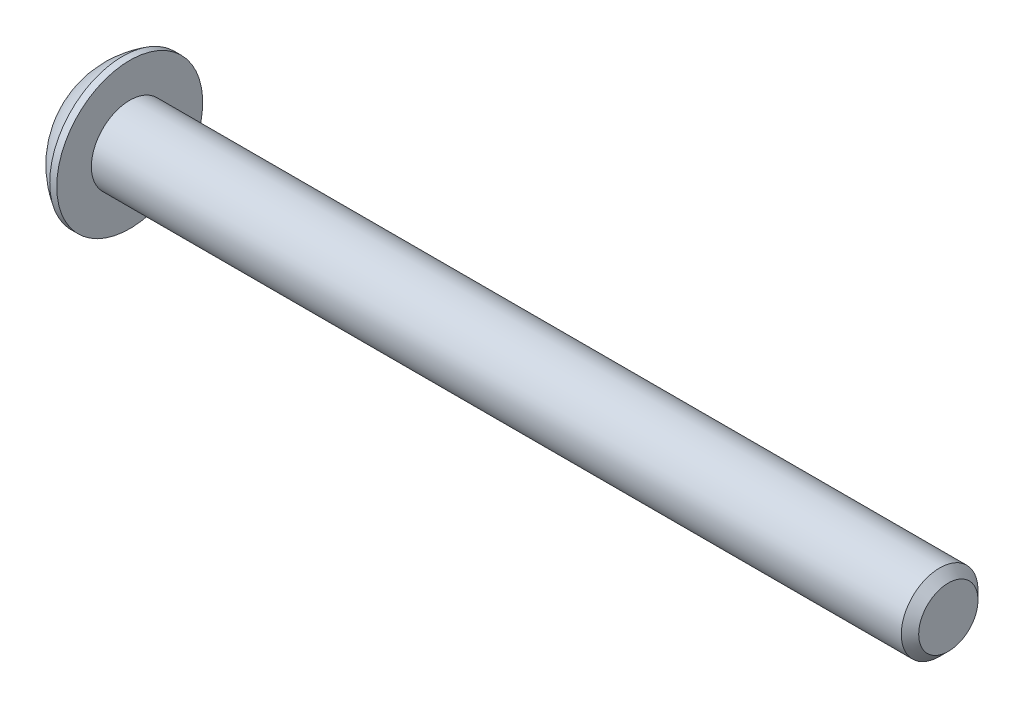
ISO-10303-21;
HEADER;
FILE_DESCRIPTION(('STEP AP214'),'2;1');
FILE_NAME('part.step','',(''),(''),'','','');
FILE_SCHEMA(('AUTOMOTIVE_DESIGN { 1 0 10303 214 1 1 1 1 }'));
ENDSEC;
DATA;
#1=APPLICATION_CONTEXT('core data for automotive mechanical design processes');
#2=APPLICATION_PROTOCOL_DEFINITION('international standard','automotive_design',2000,#1);
#3=PRODUCT_CONTEXT('',#1,'mechanical');
#4=PRODUCT('Part','Part','',(#3));
#5=PRODUCT_RELATED_PRODUCT_CATEGORY('part','',(#4));
#6=PRODUCT_DEFINITION_FORMATION('','',#4);
#7=PRODUCT_DEFINITION_CONTEXT('part definition',#1,'design');
#8=PRODUCT_DEFINITION('design','',#6,#7);
#9=PRODUCT_DEFINITION_SHAPE('','',#8);
#10=(LENGTH_UNIT() NAMED_UNIT(*) SI_UNIT(.MILLI.,.METRE.));
#11=(NAMED_UNIT(*) PLANE_ANGLE_UNIT() SI_UNIT($,.RADIAN.));
#12=(NAMED_UNIT(*) SI_UNIT($,.STERADIAN.) SOLID_ANGLE_UNIT());
#13=UNCERTAINTY_MEASURE_WITH_UNIT(LENGTH_MEASURE(1.E-05),#10,'distance_accuracy_value','');
#14=(GEOMETRIC_REPRESENTATION_CONTEXT(3) GLOBAL_UNCERTAINTY_ASSIGNED_CONTEXT((#13)) GLOBAL_UNIT_ASSIGNED_CONTEXT((#10,
#11,#12)) REPRESENTATION_CONTEXT('',''));
#15=CARTESIAN_POINT('',(0.,0.,0.));
#16=DIRECTION('',(0.,0.,1.));
#17=DIRECTION('',(1.,0.,0.));
#18=AXIS2_PLACEMENT_3D('',#15,#16,#17);
#19=CARTESIAN_POINT('',(1.32080000000034,0.,0.));
#20=DIRECTION('',(-1.,0.,0.));
#21=DIRECTION('',(0.,0.,1.));
#22=AXIS2_PLACEMENT_3D('',#19,#20,#21);
#23=CONICAL_SURFACE('',#22,1.1937999999998,1.04719755119608);
#24=CARTESIAN_POINT('',(2.01004075135902,0.,4.44089209850063E-13));
#25=VERTEX_POINT('',#24);
#26=VERTEX_LOOP('',#25);
#27=FACE_BOUND('',#26,.T.);
#28=CARTESIAN_POINT('',(1.32080000000009,0.,0.));
#29=DIRECTION('',(-1.,0.,0.));
#30=DIRECTION('',(0.,0.,1.));
#31=AXIS2_PLACEMENT_3D('',#28,#29,#30);
#32=CIRCLE('',#31,1.19380000000024);
#33=CARTESIAN_POINT('',(1.32080000000004,-1.03386112703797,0.59690000000006));
#34=VERTEX_POINT('',#33);
#35=CARTESIAN_POINT('',(1.32080000000004,0.,1.19380000000012));
#36=VERTEX_POINT('',#35);
#37=EDGE_CURVE('E19',#34,#36,#32,.T.);
#38=ORIENTED_EDGE('',*,*,#37,.T.);
#39=CARTESIAN_POINT('',(1.32080000000009,0.,0.));
#40=DIRECTION('',(-1.,0.,0.));
#41=DIRECTION('',(0.,0.,1.));
#42=AXIS2_PLACEMENT_3D('',#39,#40,#41);
#43=CIRCLE('',#42,1.19380000000024);
#44=CARTESIAN_POINT('',(1.32080000000004,1.03386112703797,0.596900000000061));
#45=VERTEX_POINT('',#44);
#46=EDGE_CURVE('E147',#36,#45,#43,.T.);
#47=ORIENTED_EDGE('',*,*,#46,.T.);
#48=CARTESIAN_POINT('',(1.32080000000009,0.,0.));
#49=DIRECTION('',(-1.,0.,0.));
#50=DIRECTION('',(0.,0.,1.));
#51=AXIS2_PLACEMENT_3D('',#48,#49,#50);
#52=CIRCLE('',#51,1.19380000000024);
#53=CARTESIAN_POINT('',(1.32080000000004,1.03386112703797,-0.596900000000061));
#54=VERTEX_POINT('',#53);
#55=EDGE_CURVE('E402',#45,#54,#52,.T.);
#56=ORIENTED_EDGE('',*,*,#55,.T.);
#57=CARTESIAN_POINT('',(1.32080000000009,0.,0.));
#58=DIRECTION('',(-1.,0.,0.));
#59=DIRECTION('',(0.,0.,1.));
#60=AXIS2_PLACEMENT_3D('',#57,#58,#59);
#61=CIRCLE('',#60,1.19380000000024);
#62=CARTESIAN_POINT('',(1.32080000000004,1.49457637585666E-12,-1.19380000000012));
#63=VERTEX_POINT('',#62);
#64=EDGE_CURVE('E403',#54,#63,#61,.T.);
#65=ORIENTED_EDGE('',*,*,#64,.T.);
#66=CARTESIAN_POINT('',(1.32080000000009,0.,0.));
#67=DIRECTION('',(-1.,0.,0.));
#68=DIRECTION('',(0.,0.,1.));
#69=AXIS2_PLACEMENT_3D('',#66,#67,#68);
#70=CIRCLE('',#69,1.19380000000024);
#71=CARTESIAN_POINT('',(1.32080000000004,-1.03386112703797,-0.59690000000006));
#72=VERTEX_POINT('',#71);
#73=EDGE_CURVE('E92',#63,#72,#70,.T.);
#74=ORIENTED_EDGE('',*,*,#73,.T.);
#75=CARTESIAN_POINT('',(1.32080000000009,0.,0.));
#76=DIRECTION('',(-1.,0.,0.));
#77=DIRECTION('',(0.,0.,1.));
#78=AXIS2_PLACEMENT_3D('',#75,#76,#77);
#79=CIRCLE('',#78,1.19380000000024);
#80=EDGE_CURVE('E88',#72,#34,#79,.T.);
#81=ORIENTED_EDGE('',*,*,#80,.T.);
#82=EDGE_LOOP('',(#38,#47,#56,#65,#74,#81));
#83=FACE_BOUND('',#82,.T.);
#84=ADVANCED_FACE('F16',(#27,#83),#23,.F.);
#85=CARTESIAN_POINT('',(1.3208,-2.06772225407572,-1.1938));
#86=DIRECTION('',(1.,0.,0.));
#87=DIRECTION('',(0.,0.,-1.));
#88=AXIS2_PLACEMENT_3D('',#85,#86,#87);
#89=PLANE('',#88);
#90=DIRECTION('',(0.,0.5,0.866025403784439));
#91=VECTOR('',#90,1.);
#92=CARTESIAN_POINT('',(1.3208,-1.37848150271715,0.));
#93=LINE('',#92,#91);
#94=CARTESIAN_POINT('',(1.3208,-0.689240751358574,1.1938));
#95=VERTEX_POINT('',#94);
#96=EDGE_CURVE('E100',#95,#34,#93,.F.);
#97=ORIENTED_EDGE('',*,*,#96,.F.);
#98=DIRECTION('',(0.,1.,0.));
#99=VECTOR('',#98,1.);
#100=CARTESIAN_POINT('',(1.3208,-0.689240751358574,1.1938));
#101=LINE('',#100,#99);
#102=EDGE_CURVE('E102',#36,#95,#101,.F.);
#103=ORIENTED_EDGE('',*,*,#102,.F.);
#104=ORIENTED_EDGE('',*,*,#37,.F.);
#105=EDGE_LOOP('',(#97,#103,#104));
#106=FACE_BOUND('',#105,.T.);
#107=ADVANCED_FACE('F98',(#106),#89,.F.);
#108=CARTESIAN_POINT('',(1.3208,-2.06772225407572,-1.1938));
#109=DIRECTION('',(1.,0.,0.));
#110=DIRECTION('',(0.,0.,-1.));
#111=AXIS2_PLACEMENT_3D('',#108,#109,#110);
#112=PLANE('',#111);
#113=DIRECTION('',(0.,-0.5,0.866025403784439));
#114=VECTOR('',#113,1.);
#115=CARTESIAN_POINT('',(1.3208,-0.689240751358574,-1.1938));
#116=LINE('',#115,#114);
#117=CARTESIAN_POINT('',(1.3208,-1.37848150271715,0.));
#118=VERTEX_POINT('',#117);
#119=EDGE_CURVE('E108',#118,#72,#116,.F.);
#120=ORIENTED_EDGE('',*,*,#119,.F.);
#121=DIRECTION('',(0.,0.5,0.866025403784439));
#122=VECTOR('',#121,1.);
#123=CARTESIAN_POINT('',(1.3208,-1.37848150271715,0.));
#124=LINE('',#123,#122);
#125=EDGE_CURVE('E105',#34,#118,#124,.F.);
#126=ORIENTED_EDGE('',*,*,#125,.F.);
#127=ORIENTED_EDGE('',*,*,#80,.F.);
#128=EDGE_LOOP('',(#120,#126,#127));
#129=FACE_BOUND('',#128,.T.);
#130=ADVANCED_FACE('F106',(#129),#112,.F.);
#131=CARTESIAN_POINT('',(1.3208,-2.06772225407572,-1.1938));
#132=DIRECTION('',(1.,0.,0.));
#133=DIRECTION('',(0.,0.,-1.));
#134=AXIS2_PLACEMENT_3D('',#131,#132,#133);
#135=PLANE('',#134);
#136=DIRECTION('',(0.,1.,0.));
#137=VECTOR('',#136,1.);
#138=CARTESIAN_POINT('',(1.3208,0.689240751358577,-1.1938));
#139=LINE('',#138,#137);
#140=CARTESIAN_POINT('',(1.3208,-0.689240751358574,-1.1938));
#141=VERTEX_POINT('',#140);
#142=EDGE_CURVE('E373',#141,#63,#139,.T.);
#143=ORIENTED_EDGE('',*,*,#142,.F.);
#144=DIRECTION('',(0.,-0.5,0.866025403784439));
#145=VECTOR('',#144,1.);
#146=CARTESIAN_POINT('',(1.3208,-0.689240751358574,-1.1938));
#147=LINE('',#146,#145);
#148=EDGE_CURVE('E385',#72,#141,#147,.F.);
#149=ORIENTED_EDGE('',*,*,#148,.F.);
#150=ORIENTED_EDGE('',*,*,#73,.F.);
#151=EDGE_LOOP('',(#143,#149,#150));
#152=FACE_BOUND('',#151,.T.);
#153=ADVANCED_FACE('F190',(#152),#135,.F.);
#154=CARTESIAN_POINT('',(1.3208,-2.06772225407572,-1.1938));
#155=DIRECTION('',(1.,0.,0.));
#156=DIRECTION('',(0.,0.,-1.));
#157=AXIS2_PLACEMENT_3D('',#154,#155,#156);
#158=PLANE('',#157);
#159=DIRECTION('',(0.,-0.5,-0.866025403784439));
#160=VECTOR('',#159,1.);
#161=CARTESIAN_POINT('',(1.3208,1.37848150271715,0.));
#162=LINE('',#161,#160);
#163=CARTESIAN_POINT('',(1.3208,0.689240751358577,-1.1938));
#164=VERTEX_POINT('',#163);
#165=EDGE_CURVE('E359',#164,#54,#162,.F.);
#166=ORIENTED_EDGE('',*,*,#165,.F.);
#167=DIRECTION('',(0.,1.,0.));
#168=VECTOR('',#167,1.);
#169=CARTESIAN_POINT('',(1.3208,0.689240751358577,-1.1938));
#170=LINE('',#169,#168);
#171=EDGE_CURVE('E370',#63,#164,#170,.T.);
#172=ORIENTED_EDGE('',*,*,#171,.F.);
#173=ORIENTED_EDGE('',*,*,#64,.F.);
#174=EDGE_LOOP('',(#166,#172,#173));
#175=FACE_BOUND('',#174,.T.);
#176=ADVANCED_FACE('F186',(#175),#158,.F.);
#177=CARTESIAN_POINT('',(1.3208,-2.06772225407572,-1.1938));
#178=DIRECTION('',(1.,0.,0.));
#179=DIRECTION('',(0.,0.,-1.));
#180=AXIS2_PLACEMENT_3D('',#177,#178,#179);
#181=PLANE('',#180);
#182=DIRECTION('',(0.,0.5,-0.866025403784439));
#183=VECTOR('',#182,1.);
#184=CARTESIAN_POINT('',(1.3208,0.689240751358576,1.1938));
#185=LINE('',#184,#183);
#186=CARTESIAN_POINT('',(1.3208,1.37848150271715,0.));
#187=VERTEX_POINT('',#186);
#188=EDGE_CURVE('E338',#187,#45,#185,.F.);
#189=ORIENTED_EDGE('',*,*,#188,.F.);
#190=DIRECTION('',(0.,-0.5,-0.866025403784439));
#191=VECTOR('',#190,1.);
#192=CARTESIAN_POINT('',(1.3208,1.37848150271715,0.));
#193=LINE('',#192,#191);
#194=EDGE_CURVE('E357',#54,#187,#193,.F.);
#195=ORIENTED_EDGE('',*,*,#194,.F.);
#196=ORIENTED_EDGE('',*,*,#55,.F.);
#197=EDGE_LOOP('',(#189,#195,#196));
#198=FACE_BOUND('',#197,.T.);
#199=ADVANCED_FACE('F182',(#198),#181,.F.);
#200=CARTESIAN_POINT('',(1.3208,-2.06772225407572,-1.1938));
#201=DIRECTION('',(1.,0.,0.));
#202=DIRECTION('',(0.,0.,-1.));
#203=AXIS2_PLACEMENT_3D('',#200,#201,#202);
#204=PLANE('',#203);
#205=DIRECTION('',(0.,1.,0.));
#206=VECTOR('',#205,1.);
#207=CARTESIAN_POINT('',(1.3208,-0.689240751358574,1.1938));
#208=LINE('',#207,#206);
#209=CARTESIAN_POINT('',(1.3208,0.689240751358576,1.1938));
#210=VERTEX_POINT('',#209);
#211=EDGE_CURVE('E117',#210,#36,#208,.F.);
#212=ORIENTED_EDGE('',*,*,#211,.F.);
#213=DIRECTION('',(0.,0.5,-0.866025403784439));
#214=VECTOR('',#213,1.);
#215=CARTESIAN_POINT('',(1.3208,0.689240751358576,1.1938));
#216=LINE('',#215,#214);
#217=EDGE_CURVE('E341',#45,#210,#216,.F.);
#218=ORIENTED_EDGE('',*,*,#217,.F.);
#219=ORIENTED_EDGE('',*,*,#46,.F.);
#220=EDGE_LOOP('',(#212,#218,#219));
#221=FACE_BOUND('',#220,.T.);
#222=ADVANCED_FACE('F178',(#221),#204,.F.);
#223=CARTESIAN_POINT('',(1.3208,-0.689240751358574,1.1938));
#224=DIRECTION('',(0.,0.,-1.));
#225=DIRECTION('',(0.,1.,0.));
#226=AXIS2_PLACEMENT_3D('',#223,#224,#225);
#227=PLANE('',#226);
#228=DIRECTION('',(0.,1.,0.));
#229=VECTOR('',#228,1.);
#230=CARTESIAN_POINT('',(0.,0.,1.1938));
#231=LINE('',#230,#229);
#232=CARTESIAN_POINT('',(0.,0.689240751358577,1.1938));
#233=VERTEX_POINT('',#232);
#234=CARTESIAN_POINT('',(0.,-0.689240751358574,1.1938));
#235=VERTEX_POINT('',#234);
#236=EDGE_CURVE('E335',#233,#235,#231,.F.);
#237=ORIENTED_EDGE('',*,*,#236,.F.);
#238=DIRECTION('',(1.,0.,0.));
#239=VECTOR('',#238,1.);
#240=CARTESIAN_POINT('',(1.3208,0.689240751358576,1.1938));
#241=LINE('',#240,#239);
#242=EDGE_CURVE('E347',#210,#233,#241,.F.);
#243=ORIENTED_EDGE('',*,*,#242,.F.);
#244=ORIENTED_EDGE('',*,*,#211,.T.);
#245=ORIENTED_EDGE('',*,*,#102,.T.);
#246=DIRECTION('',(1.,0.,0.));
#247=VECTOR('',#246,1.);
#248=CARTESIAN_POINT('',(1.3208,-0.689240751358574,1.1938));
#249=LINE('',#248,#247);
#250=EDGE_CURVE('E111',#235,#95,#249,.T.);
#251=ORIENTED_EDGE('',*,*,#250,.F.);
#252=EDGE_LOOP('',(#237,#243,#244,#245,#251));
#253=FACE_BOUND('',#252,.T.);
#254=ADVANCED_FACE('F175',(#253),#227,.T.);
#255=CARTESIAN_POINT('',(1.3208,-1.37848150271715,0.));
#256=DIRECTION('',(0.,0.866025403784439,-0.5));
#257=DIRECTION('',(0.,0.5,0.866025403784439));
#258=AXIS2_PLACEMENT_3D('',#255,#256,#257);
#259=PLANE('',#258);
#260=DIRECTION('',(0.,-0.5,-0.866025403784439));
#261=VECTOR('',#260,1.);
#262=CARTESIAN_POINT('',(0.,-0.689240751358574,1.1938));
#263=LINE('',#262,#261);
#264=CARTESIAN_POINT('',(0.,-1.37848150271715,0.));
#265=VERTEX_POINT('',#264);
#266=EDGE_CURVE('E332',#235,#265,#263,.T.);
#267=ORIENTED_EDGE('',*,*,#266,.F.);
#268=ORIENTED_EDGE('',*,*,#250,.T.);
#269=ORIENTED_EDGE('',*,*,#96,.T.);
#270=ORIENTED_EDGE('',*,*,#125,.T.);
#271=DIRECTION('',(1.,0.,0.));
#272=VECTOR('',#271,1.);
#273=CARTESIAN_POINT('',(1.3208,-1.37848150271715,0.));
#274=LINE('',#273,#272);
#275=EDGE_CURVE('E382',#265,#118,#274,.T.);
#276=ORIENTED_EDGE('',*,*,#275,.F.);
#277=EDGE_LOOP('',(#267,#268,#269,#270,#276));
#278=FACE_BOUND('',#277,.T.);
#279=ADVANCED_FACE('F115',(#278),#259,.T.);
#280=CARTESIAN_POINT('',(1.3208,-0.689240751358574,-1.1938));
#281=DIRECTION('',(0.,0.866025403784439,0.5));
#282=DIRECTION('',(0.,-0.5,0.866025403784439));
#283=AXIS2_PLACEMENT_3D('',#280,#281,#282);
#284=PLANE('',#283);
#285=DIRECTION('',(0.,0.5,-0.866025403784439));
#286=VECTOR('',#285,1.);
#287=CARTESIAN_POINT('',(0.,-1.37848150271715,0.));
#288=LINE('',#287,#286);
#289=CARTESIAN_POINT('',(0.,-0.689240751358574,-1.1938));
#290=VERTEX_POINT('',#289);
#291=EDGE_CURVE('E329',#265,#290,#288,.T.);
#292=ORIENTED_EDGE('',*,*,#291,.F.);
#293=ORIENTED_EDGE('',*,*,#275,.T.);
#294=ORIENTED_EDGE('',*,*,#119,.T.);
#295=ORIENTED_EDGE('',*,*,#148,.T.);
#296=DIRECTION('',(1.,0.,0.));
#297=VECTOR('',#296,1.);
#298=CARTESIAN_POINT('',(1.3208,-0.689240751358574,-1.1938));
#299=LINE('',#298,#297);
#300=EDGE_CURVE('E367',#290,#141,#299,.T.);
#301=ORIENTED_EDGE('',*,*,#300,.F.);
#302=EDGE_LOOP('',(#292,#293,#294,#295,#301));
#303=FACE_BOUND('',#302,.T.);
#304=ADVANCED_FACE('F168',(#303),#284,.T.);
#305=CARTESIAN_POINT('',(1.3208,0.689240751358577,-1.1938));
#306=DIRECTION('',(0.,0.,1.));
#307=DIRECTION('',(1.,0.,0.));
#308=AXIS2_PLACEMENT_3D('',#305,#306,#307);
#309=PLANE('',#308);
#310=DIRECTION('',(0.,1.,0.));
#311=VECTOR('',#310,1.);
#312=CARTESIAN_POINT('',(0.,0.,-1.1938));
#313=LINE('',#312,#311);
#314=CARTESIAN_POINT('',(0.,0.689240751358577,-1.1938));
#315=VERTEX_POINT('',#314);
#316=EDGE_CURVE('E326',#290,#315,#313,.T.);
#317=ORIENTED_EDGE('',*,*,#316,.F.);
#318=ORIENTED_EDGE('',*,*,#300,.T.);
#319=ORIENTED_EDGE('',*,*,#142,.T.);
#320=ORIENTED_EDGE('',*,*,#171,.T.);
#321=DIRECTION('',(1.,0.,0.));
#322=VECTOR('',#321,1.);
#323=CARTESIAN_POINT('',(1.3208,0.689240751358577,-1.1938));
#324=LINE('',#323,#322);
#325=EDGE_CURVE('E342',#315,#164,#324,.T.);
#326=ORIENTED_EDGE('',*,*,#325,.F.);
#327=EDGE_LOOP('',(#317,#318,#319,#320,#326));
#328=FACE_BOUND('',#327,.T.);
#329=ADVANCED_FACE('F165',(#328),#309,.T.);
#330=CARTESIAN_POINT('',(1.3208,1.37848150271715,0.));
#331=DIRECTION('',(0.,-0.866025403784439,0.5));
#332=DIRECTION('',(0.,-0.5,-0.866025403784439));
#333=AXIS2_PLACEMENT_3D('',#330,#331,#332);
#334=PLANE('',#333);
#335=DIRECTION('',(0.,0.5,0.866025403784439));
#336=VECTOR('',#335,1.);
#337=CARTESIAN_POINT('',(0.,0.689240751358577,-1.1938));
#338=LINE('',#337,#336);
#339=CARTESIAN_POINT('',(0.,1.37848150271715,0.));
#340=VERTEX_POINT('',#339);
#341=EDGE_CURVE('E323',#315,#340,#338,.T.);
#342=ORIENTED_EDGE('',*,*,#341,.F.);
#343=ORIENTED_EDGE('',*,*,#325,.T.);
#344=ORIENTED_EDGE('',*,*,#165,.T.);
#345=ORIENTED_EDGE('',*,*,#194,.T.);
#346=DIRECTION('',(1.,0.,0.));
#347=VECTOR('',#346,1.);
#348=CARTESIAN_POINT('',(1.3208,1.37848150271715,0.));
#349=LINE('',#348,#347);
#350=EDGE_CURVE('E34',#340,#187,#349,.T.);
#351=ORIENTED_EDGE('',*,*,#350,.F.);
#352=EDGE_LOOP('',(#342,#343,#344,#345,#351));
#353=FACE_BOUND('',#352,.T.);
#354=ADVANCED_FACE('F161',(#353),#334,.T.);
#355=CARTESIAN_POINT('',(1.3208,0.689240751358576,1.1938));
#356=DIRECTION('',(0.,-0.866025403784439,-0.5));
#357=DIRECTION('',(0.,0.5,-0.866025403784439));
#358=AXIS2_PLACEMENT_3D('',#355,#356,#357);
#359=PLANE('',#358);
#360=DIRECTION('',(0.,-0.5,0.866025403784439));
#361=VECTOR('',#360,1.);
#362=CARTESIAN_POINT('',(0.,1.37848150271715,0.));
#363=LINE('',#362,#361);
#364=EDGE_CURVE('E146',#340,#233,#363,.T.);
#365=ORIENTED_EDGE('',*,*,#364,.F.);
#366=ORIENTED_EDGE('',*,*,#350,.T.);
#367=ORIENTED_EDGE('',*,*,#188,.T.);
#368=ORIENTED_EDGE('',*,*,#217,.T.);
#369=ORIENTED_EDGE('',*,*,#242,.T.);
#370=EDGE_LOOP('',(#365,#366,#367,#368,#369));
#371=FACE_BOUND('',#370,.T.);
#372=ADVANCED_FACE('F157',(#371),#359,.T.);
#373=CARTESIAN_POINT('',(0.,0.,0.));
#374=DIRECTION('',(-1.,0.,0.));
#375=DIRECTION('',(0.,0.,1.));
#376=AXIS2_PLACEMENT_3D('',#373,#374,#375);
#377=PLANE('',#376);
#378=ORIENTED_EDGE('',*,*,#341,.T.);
#379=ORIENTED_EDGE('',*,*,#364,.T.);
#380=ORIENTED_EDGE('',*,*,#236,.T.);
#381=ORIENTED_EDGE('',*,*,#266,.T.);
#382=ORIENTED_EDGE('',*,*,#291,.T.);
#383=ORIENTED_EDGE('',*,*,#316,.T.);
#384=EDGE_LOOP('',(#378,#379,#380,#381,#382,#383));
#385=FACE_BOUND('',#384,.T.);
#386=CARTESIAN_POINT('',(0.,1.9812,0.));
#387=CARTESIAN_POINT('',(0.,1.9811996664299,0.0556258831179428));
#388=CARTESIAN_POINT('',(0.,1.97885520380442,0.111261989398606));
#389=CARTESIAN_POINT('',(0.,1.96949260169541,0.222149719830458));
#390=CARTESIAN_POINT('',(0.,1.96247308239605,0.277401225602895));
#391=CARTESIAN_POINT('',(0.,1.94379192841038,0.387209508139747));
#392=CARTESIAN_POINT('',(-1.85325793235264E-13,1.93212292489526,0.441765039546365));
#393=CARTESIAN_POINT('',(1.86344214223505E-13,1.90422331175315,0.549729449347493));
#394=CARTESIAN_POINT('',(6.94543371897454E-13,1.88798900035338,0.603137359208869));
#395=CARTESIAN_POINT('',(1.15501975216981E-12,1.83266214476501,0.760839131321828));
#396=CARTESIAN_POINT('',(0.,1.78690023648845,0.862876433575429));
#397=CARTESIAN_POINT('',(0.,1.67887358150667,1.05780719540872));
#398=CARTESIAN_POINT('',(9.54193214892627E-13,1.6166082074585,1.15070030720801));
#399=CARTESIAN_POINT('',(5.94805591894675E-13,1.51224157140982,1.28116890915697));
#400=CARTESIAN_POINT('',(1.63221293851378E-13,1.4755970394354,1.32320451127026));
#401=CARTESIAN_POINT('',(-1.62196980336157E-13,1.39893832619713,1.40400288695709));
#402=CARTESIAN_POINT('',(0.,1.35892742784698,1.44276877695455));
#403=CARTESIAN_POINT('',(1.14362537325405E-13,1.23416504602197,1.55382272417904));
#404=CARTESIAN_POINT('',(0.,1.14466125559859,1.62089527952111));
#405=CARTESIAN_POINT('',(0.,0.955712144178167,1.7390221808118));
#406=CARTESIAN_POINT('',(0.,0.856267198233564,1.79007713076007));
#407=CARTESIAN_POINT('',(0.,0.650206345910843,1.87477637530954));
#408=CARTESIAN_POINT('',(0.,0.543590516134855,1.90842085586267));
#409=CARTESIAN_POINT('',(0.,0.326226155292018,1.95733039300656));
#410=CARTESIAN_POINT('',(0.,0.21547760215793,1.97259535144288));
#411=CARTESIAN_POINT('',(0.,-0.00701040587544639,1.98431697865418));
#412=CARTESIAN_POINT('',(0.,-0.118749860774734,1.98077364742917));
#413=CARTESIAN_POINT('',(0.,-0.340050178355485,1.95497485623825));
#414=CARTESIAN_POINT('',(0.,-0.449611052668255,1.93271949620218));
#415=CARTESIAN_POINT('',(0.,-0.663431110729174,1.87014138774523));
#416=CARTESIAN_POINT('',(0.,-0.76769023783852,1.82981844635272));
#417=CARTESIAN_POINT('',(0.,-0.968005760719347,1.73219968377096));
#418=CARTESIAN_POINT('',(0.,-1.0640618469811,1.6749032225164));
#419=CARTESIAN_POINT('',(0.,-1.19980276751283,1.57757371205873));
#420=CARTESIAN_POINT('',(0.,-1.24366557129213,1.54322665019466));
#421=CARTESIAN_POINT('',(0.,-1.32838995706696,1.47093063174264));
#422=CARTESIAN_POINT('',(0.,-1.36924860178706,1.43297823102439));
#423=CARTESIAN_POINT('',(0.,-1.48674671849223,1.31419842051173));
#424=CARTESIAN_POINT('',(0.,-1.55842832343237,1.22836221289311));
#425=CARTESIAN_POINT('',(0.,-1.6863396856475,1.04586168272493));
#426=CARTESIAN_POINT('',(0.,-1.7425700302488,0.949197771949774));
#427=CARTESIAN_POINT('',(0.,-1.8141614250401,0.798182600298684));
#428=CARTESIAN_POINT('',(0.,-1.83591780585875,0.746776203847791));
#429=CARTESIAN_POINT('',(0.,-1.87500754181092,0.642341081688636));
#430=CARTESIAN_POINT('',(0.,-1.89234447645404,0.589313708122847));
#431=CARTESIAN_POINT('',(0.,-1.92246053433554,0.482076273028395));
#432=CARTESIAN_POINT('',(0.,-1.93524685475118,0.42786822425751));
#433=CARTESIAN_POINT('',(0.,-1.95620937250494,0.318578151844611));
#434=CARTESIAN_POINT('',(0.,-1.96438692958147,0.263496390912872));
#435=CARTESIAN_POINT('',(0.,-1.97388528284653,0.173607715038558));
#436=CARTESIAN_POINT('',(0.,-1.97662743364426,0.138944718024998));
#437=CARTESIAN_POINT('',(0.,-1.98028489645283,0.0695224782567002));
#438=CARTESIAN_POINT('',(0.,-1.98120020846367,0.0347632355019631));
#439=CARTESIAN_POINT('',(0.,-1.9811996664299,-0.0556258831179437));
#440=CARTESIAN_POINT('',(0.,-1.97885520380442,-0.111261989398607));
#441=CARTESIAN_POINT('',(0.,-1.96949260169541,-0.222149719830459));
#442=CARTESIAN_POINT('',(0.,-1.96247308239605,-0.277401225602897));
#443=CARTESIAN_POINT('',(0.,-1.94379192841039,-0.387209508139749));
#444=CARTESIAN_POINT('',(-1.85269749640691E-13,-1.93212292489526,-0.441765039546367));
#445=CARTESIAN_POINT('',(1.86288125054388E-13,-1.90422331175315,-0.549729449347495));
#446=CARTESIAN_POINT('',(6.94525090263764E-13,-1.88798900035338,-0.603137359208872));
#447=CARTESIAN_POINT('',(1.15505622829081E-12,-1.83266214476501,-0.760839131321831));
#448=CARTESIAN_POINT('',(0.,-1.78690023648845,-0.862876433575431));
#449=CARTESIAN_POINT('',(0.,-1.67887358150667,-1.05780719540872));
#450=CARTESIAN_POINT('',(9.54248812869379E-13,-1.6166082074585,-1.15070030720801));
#451=CARTESIAN_POINT('',(5.94777756479239E-13,-1.51224157140982,-1.28116890915698));
#452=CARTESIAN_POINT('',(1.63138949183833E-13,-1.47559703943539,-1.32320451127027));
#453=CARTESIAN_POINT('',(-1.62114715061273E-13,-1.39893832619713,-1.40400288695709));
#454=CARTESIAN_POINT('',(0.,-1.35892742784699,-1.44276877695455));
#455=CARTESIAN_POINT('',(1.13760489124207E-13,-1.23416504602197,-1.55382272417904));
#456=CARTESIAN_POINT('',(0.,-1.14466125559859,-1.62089527952111));
#457=CARTESIAN_POINT('',(0.,-0.95571214417816,-1.73902218081179));
#458=CARTESIAN_POINT('',(0.,-0.856267198233559,-1.79007713076007));
#459=CARTESIAN_POINT('',(0.,-0.650206345910841,-1.87477637530954));
#460=CARTESIAN_POINT('',(0.,-0.543590516134854,-1.90842085586267));
#461=CARTESIAN_POINT('',(0.,-0.326226155292018,-1.95733039300657));
#462=CARTESIAN_POINT('',(0.,-0.215477602157929,-1.97259535144288));
#463=CARTESIAN_POINT('',(0.,0.0070104058754487,-1.98431697865418));
#464=CARTESIAN_POINT('',(0.,0.118749860774737,-1.98077364742916));
#465=CARTESIAN_POINT('',(0.,0.340050178355489,-1.95497485623824));
#466=CARTESIAN_POINT('',(0.,0.44961105266826,-1.93271949620218));
#467=CARTESIAN_POINT('',(0.,0.663431110729178,-1.87014138774524));
#468=CARTESIAN_POINT('',(0.,0.767690237838524,-1.82981844635272));
#469=CARTESIAN_POINT('',(0.,0.968005760719348,-1.73219968377096));
#470=CARTESIAN_POINT('',(0.,1.0640618469811,-1.67490322251639));
#471=CARTESIAN_POINT('',(0.,1.19980276751283,-1.57757371205873));
#472=CARTESIAN_POINT('',(0.,1.24366557129214,-1.54322665019465));
#473=CARTESIAN_POINT('',(0.,1.32838995706696,-1.47093063174263));
#474=CARTESIAN_POINT('',(0.,1.36924860178706,-1.43297823102439));
#475=CARTESIAN_POINT('',(0.,1.48674671849223,-1.31419842051172));
#476=CARTESIAN_POINT('',(0.,1.55842832343237,-1.22836221289311));
#477=CARTESIAN_POINT('',(0.,1.6863396856475,-1.04586168272492));
#478=CARTESIAN_POINT('',(0.,1.7425700302488,-0.949197771949768));
#479=CARTESIAN_POINT('',(0.,1.8141614250401,-0.798182600298677));
#480=CARTESIAN_POINT('',(0.,1.83591780585875,-0.746776203847785));
#481=CARTESIAN_POINT('',(0.,1.87500754181092,-0.64234108168863));
#482=CARTESIAN_POINT('',(0.,1.89234447645404,-0.589313708122841));
#483=CARTESIAN_POINT('',(0.,1.92246053433555,-0.482076273028389));
#484=CARTESIAN_POINT('',(0.,1.93524685475118,-0.427868224257505));
#485=CARTESIAN_POINT('',(0.,1.95620937250494,-0.318578151844605));
#486=CARTESIAN_POINT('',(0.,1.96438692958147,-0.263496390912866));
#487=CARTESIAN_POINT('',(0.,1.97388528284653,-0.173607715038553));
#488=CARTESIAN_POINT('',(0.,1.97662743364426,-0.138944718024994));
#489=CARTESIAN_POINT('',(0.,1.98028489645283,-0.0695224782566989));
#490=CARTESIAN_POINT('',(0.,1.98120020846367,-0.034763235501963));
#491=CARTESIAN_POINT('',(0.,1.9812,0.));
#492=B_SPLINE_CURVE_WITH_KNOTS('',3,(#386,#387,#388,#389,#390,#391,#392,#393,#394,#395,#396,
#397,#398,#399,#400,#401,#402,#403,#404,#405,#406,#407,#408,#409,#410,#411,#412,#413,#414,#415,
#416,#417,#418,#419,#420,#421,#422,#423,#424,#425,#426,#427,#428,#429,#430,#431,#432,#433,#434,
#435,#436,#437,#438,#439,#440,#441,#442,#443,#444,#445,#446,#447,#448,#449,#450,#451,#452,#453,
#454,#455,#456,#457,#458,#459,#460,#461,#462,#463,#464,#465,#466,#467,#468,#469,#470,#471,#472,
#473,#474,#475,#476,#477,#478,#479,#480,#481,#482,#483,#484,#485,#486,#487,#488,#489,#490,#491),
.UNSPECIFIED.,.T.,.F.,(4,2,2,2,2,2,2,2,2,2,2,2,2,2,2,2,2,2,2,2,2,2,2,2,2,2,2,2,2,2,2,2,2,2,2,2,
2,2,2,2,2,2,2,2,2,2,2,2,2,2,2,2,4),(0.,0.166845646007828,0.333740557374255,0.500901034367693,
0.668197445942386,1.00199278686282,1.33580081809885,1.50292354032982,1.6698851310853,
2.00370118900129,2.33750465770544,2.67130456115909,3.005106247238,3.33890793331696,
3.67270783677065,4.00651130547476,4.34032736339026,4.50728895414554,4.67441167637632,
5.00821970761259,5.34201504853332,5.50931146010827,5.67647193710191,5.84336684846844,
6.0102124944764,6.11448220058334,6.21875190669029,6.38559755269812,6.55249246406454,
6.71965294105798,6.88694935263268,7.22074469355311,7.55455272478915,7.72167544702011,
7.88863703777559,8.22245309569158,8.55625656439573,8.89005646784938,9.2238581539283,
9.55765984000725,9.89145974346094,10.2252632121651,10.5590792700806,10.7260408608358,
10.8931635830666,11.2269716143029,11.5607669552236,11.7280633667986,11.8952238437922,
12.0621187551587,12.2289644011667,12.3332341072736,12.4375038133806),.UNSPECIFIED.);
#493=CARTESIAN_POINT('',(0.,1.9812,0.));
#494=VERTEX_POINT('',#493);
#495=EDGE_CURVE('E139',#494,#494,#492,.T.);
#496=ORIENTED_EDGE('',*,*,#495,.F.);
#497=EDGE_LOOP('',(#496));
#498=FACE_BOUND('',#497,.T.);
#499=ADVANCED_FACE('F153',(#385,#498),#377,.T.);
#500=CARTESIAN_POINT('',(4.13385,0.,0.));
#501=DIRECTION('',(0.,1.,0.));
#502=DIRECTION('',(1.,0.,0.));
#503=AXIS2_PLACEMENT_3D('',#500,#501,#502);
#504=SPHERICAL_SURFACE('',#503,4.58408870578439);
#505=CARTESIAN_POINT('',(1.8288,0.,0.));
#506=DIRECTION('',(-1.,0.,0.));
#507=DIRECTION('',(0.,0.,1.));
#508=AXIS2_PLACEMENT_3D('',#505,#506,#507);
#509=CIRCLE('',#508,3.9624);
#510=CARTESIAN_POINT('',(1.8288,0.,3.9624));
#511=VERTEX_POINT('',#510);
#512=EDGE_CURVE('E136',#511,#511,#509,.F.);
#513=ORIENTED_EDGE('',*,*,#512,.F.);
#514=EDGE_LOOP('',(#513));
#515=FACE_BOUND('',#514,.T.);
#516=ORIENTED_EDGE('',*,*,#495,.T.);
#517=EDGE_LOOP('',(#516));
#518=FACE_BOUND('',#517,.T.);
#519=ADVANCED_FACE('F149',(#515,#518),#504,.T.);
#520=CARTESIAN_POINT('',(46.6598,0.,0.));
#521=DIRECTION('',(-1.,0.,0.));
#522=DIRECTION('',(0.,0.,1.));
#523=AXIS2_PLACEMENT_3D('',#520,#521,#522);
#524=PLANE('',#523);
#525=CARTESIAN_POINT('',(46.6597999999863,0.,0.));
#526=DIRECTION('',(-1.,0.,0.));
#527=DIRECTION('',(0.,0.,1.));
#528=AXIS2_PLACEMENT_3D('',#525,#526,#527);
#529=CIRCLE('',#528,1.61036000002923);
#530=CARTESIAN_POINT('',(46.6597999999863,0.,1.61036000002923));
#531=VERTEX_POINT('',#530);
#532=EDGE_CURVE('E133',#531,#531,#529,.T.);
#533=ORIENTED_EDGE('',*,*,#532,.F.);
#534=EDGE_LOOP('',(#533));
#535=FACE_BOUND('',#534,.T.);
#536=ADVANCED_FACE('F220',(#535),#524,.F.);
#537=CARTESIAN_POINT('',(0.,0.,0.));
#538=DIRECTION('',(-1.,0.,0.));
#539=DIRECTION('',(0.,0.,1.));
#540=AXIS2_PLACEMENT_3D('',#537,#538,#539);
#541=CYLINDRICAL_SURFACE('',#540,3.9624);
#542=ORIENTED_EDGE('',*,*,#512,.T.);
#543=EDGE_LOOP('',(#542));
#544=FACE_BOUND('',#543,.T.);
#545=CARTESIAN_POINT('',(2.2098,0.,0.));
#546=DIRECTION('',(-1.,0.,0.));
#547=DIRECTION('',(0.,0.,1.));
#548=AXIS2_PLACEMENT_3D('',#545,#546,#547);
#549=CIRCLE('',#548,3.9624);
#550=CARTESIAN_POINT('',(2.2098,0.,3.9624));
#551=VERTEX_POINT('',#550);
#552=EDGE_CURVE('E130',#551,#551,#549,.T.);
#553=ORIENTED_EDGE('',*,*,#552,.T.);
#554=EDGE_LOOP('',(#553));
#555=FACE_BOUND('',#554,.T.);
#556=ADVANCED_FACE('F217',(#544,#555),#541,.T.);
#557=CARTESIAN_POINT('',(46.1873600000899,0.,0.));
#558=DIRECTION('',(-1.,0.,0.));
#559=DIRECTION('',(0.,0.,1.));
#560=AXIS2_PLACEMENT_3D('',#557,#558,#559);
#561=CONICAL_SURFACE('',#560,2.08279999992556,0.785398163397448);
#562=CARTESIAN_POINT('',(46.18736,0.,0.));
#563=DIRECTION('',(-1.,0.,0.));
#564=DIRECTION('',(0.,0.,1.));
#565=AXIS2_PLACEMENT_3D('',#562,#563,#564);
#566=CIRCLE('',#565,2.0828);
#567=CARTESIAN_POINT('',(46.18736,0.,2.0828));
#568=VERTEX_POINT('',#567);
#569=EDGE_CURVE('E25',#568,#568,#566,.T.);
#570=ORIENTED_EDGE('',*,*,#569,.F.);
#571=EDGE_LOOP('',(#570));
#572=FACE_BOUND('',#571,.T.);
#573=ORIENTED_EDGE('',*,*,#532,.T.);
#574=EDGE_LOOP('',(#573));
#575=FACE_BOUND('',#574,.T.);
#576=ADVANCED_FACE('F210',(#572,#575),#561,.T.);
#577=CARTESIAN_POINT('',(2.2098,2.0828,0.));
#578=DIRECTION('',(-1.,0.,0.));
#579=DIRECTION('',(0.,0.,1.));
#580=AXIS2_PLACEMENT_3D('',#577,#578,#579);
#581=PLANE('',#580);
#582=CARTESIAN_POINT('',(2.2098,0.,0.));
#583=DIRECTION('',(-1.,0.,0.));
#584=DIRECTION('',(0.,0.,1.));
#585=AXIS2_PLACEMENT_3D('',#582,#583,#584);
#586=CIRCLE('',#585,2.0828);
#587=CARTESIAN_POINT('',(2.2098,0.,2.0828));
#588=VERTEX_POINT('',#587);
#589=EDGE_CURVE('E10',#588,#588,#586,.F.);
#590=ORIENTED_EDGE('',*,*,#589,.F.);
#591=EDGE_LOOP('',(#590));
#592=FACE_BOUND('',#591,.T.);
#593=ORIENTED_EDGE('',*,*,#552,.F.);
#594=EDGE_LOOP('',(#593));
#595=FACE_BOUND('',#594,.T.);
#596=ADVANCED_FACE('F204',(#592,#595),#581,.F.);
#597=CARTESIAN_POINT('',(0.,0.,0.));
#598=DIRECTION('',(-1.,0.,0.));
#599=DIRECTION('',(0.,0.,1.));
#600=AXIS2_PLACEMENT_3D('',#597,#598,#599);
#601=CYLINDRICAL_SURFACE('',#600,2.0828);
#602=ORIENTED_EDGE('',*,*,#589,.T.);
#603=EDGE_LOOP('',(#602));
#604=FACE_BOUND('',#603,.T.);
#605=ORIENTED_EDGE('',*,*,#569,.T.);
#606=EDGE_LOOP('',(#605));
#607=FACE_BOUND('',#606,.T.);
#608=ADVANCED_FACE('F202',(#604,#607),#601,.T.);
#609=CLOSED_SHELL('',(#84,#107,#130,#153,#176,#199,#222,#254,#279,#304,#329,#354,#372,#499,#519,
#536,#556,#576,#596,#608));
#610=MANIFOLD_SOLID_BREP('B1',#609);
#611=ADVANCED_BREP_SHAPE_REPRESENTATION('',(#18,#610),#14);
#612=SHAPE_DEFINITION_REPRESENTATION(#9,#611);
ENDSEC;
END-ISO-10303-21;
